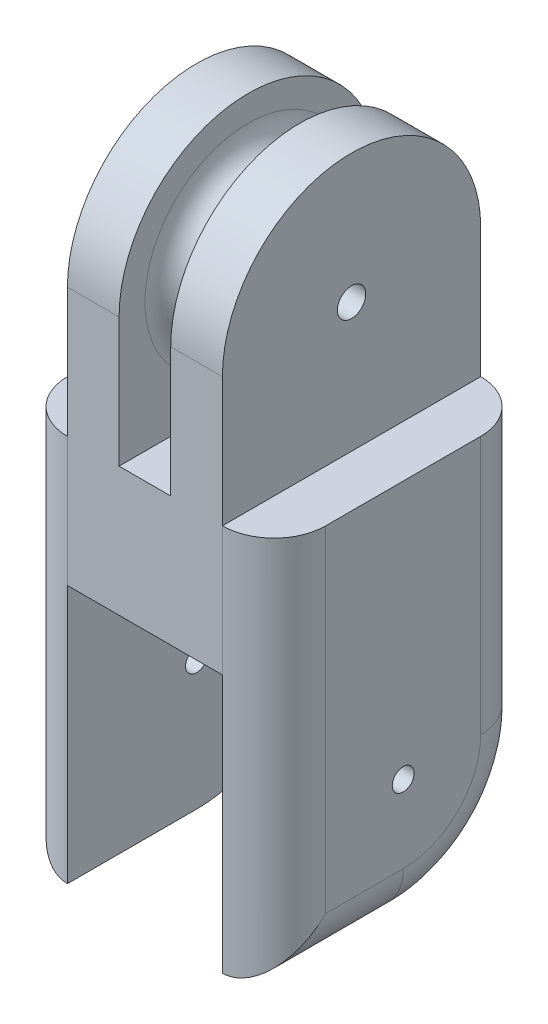
ISO-10303-21;
HEADER;
FILE_DESCRIPTION(('STEP AP214'),'2;1');
FILE_NAME('part.step','',(''),(''),'','','');
FILE_SCHEMA(('AUTOMOTIVE_DESIGN { 1 0 10303 214 1 1 1 1 }'));
ENDSEC;
DATA;
#1=APPLICATION_CONTEXT('core data for automotive mechanical design processes');
#2=APPLICATION_PROTOCOL_DEFINITION('international standard','automotive_design',2000,#1);
#3=PRODUCT_CONTEXT('',#1,'mechanical');
#4=PRODUCT('Part','Part','',(#3));
#5=PRODUCT_RELATED_PRODUCT_CATEGORY('part','',(#4));
#6=PRODUCT_DEFINITION_FORMATION('','',#4);
#7=PRODUCT_DEFINITION_CONTEXT('part definition',#1,'design');
#8=PRODUCT_DEFINITION('design','',#6,#7);
#9=PRODUCT_DEFINITION_SHAPE('','',#8);
#10=(LENGTH_UNIT() NAMED_UNIT(*) SI_UNIT(.MILLI.,.METRE.));
#11=(NAMED_UNIT(*) PLANE_ANGLE_UNIT() SI_UNIT($,.RADIAN.));
#12=(NAMED_UNIT(*) SI_UNIT($,.STERADIAN.) SOLID_ANGLE_UNIT());
#13=UNCERTAINTY_MEASURE_WITH_UNIT(LENGTH_MEASURE(1.E-05),#10,'distance_accuracy_value','');
#14=(GEOMETRIC_REPRESENTATION_CONTEXT(3) GLOBAL_UNCERTAINTY_ASSIGNED_CONTEXT((#13)) GLOBAL_UNIT_ASSIGNED_CONTEXT((#10,
#11,#12)) REPRESENTATION_CONTEXT('',''));
#15=CARTESIAN_POINT('',(0.,0.,0.));
#16=DIRECTION('',(0.,0.,1.));
#17=DIRECTION('',(1.,0.,0.));
#18=AXIS2_PLACEMENT_3D('',#15,#16,#17);
#19=CARTESIAN_POINT('',(0.,10.,0.));
#20=DIRECTION('',(0.,1.,0.));
#21=DIRECTION('',(0.,0.,1.));
#22=AXIS2_PLACEMENT_3D('',#19,#20,#21);
#23=PLANE('',#22);
#24=CARTESIAN_POINT('',(-6.,10.,6.));
#25=DIRECTION('',(0.,1.,0.));
#26=DIRECTION('',(0.,0.,1.));
#27=AXIS2_PLACEMENT_3D('',#24,#25,#26);
#28=CIRCLE('',#27,4.);
#29=CARTESIAN_POINT('',(-10.,10.,6.));
#30=VERTEX_POINT('',#29);
#31=CARTESIAN_POINT('',(-6.,10.,10.));
#32=VERTEX_POINT('',#31);
#33=EDGE_CURVE('E316',#30,#32,#28,.T.);
#34=ORIENTED_EDGE('',*,*,#33,.T.);
#35=DIRECTION('',(0.,0.,1.));
#36=VECTOR('',#35,1.);
#37=CARTESIAN_POINT('',(-6.,10.,10.));
#38=LINE('',#37,#36);
#39=CARTESIAN_POINT('',(-6.,10.,-10.));
#40=VERTEX_POINT('',#39);
#41=EDGE_CURVE('E169',#40,#32,#38,.T.);
#42=ORIENTED_EDGE('',*,*,#41,.F.);
#43=CARTESIAN_POINT('',(-6.,10.,-6.));
#44=DIRECTION('',(0.,1.,0.));
#45=DIRECTION('',(0.,0.,1.));
#46=AXIS2_PLACEMENT_3D('',#43,#44,#45);
#47=CIRCLE('',#46,4.);
#48=CARTESIAN_POINT('',(-10.,10.,-6.));
#49=VERTEX_POINT('',#48);
#50=EDGE_CURVE('E314',#40,#49,#47,.T.);
#51=ORIENTED_EDGE('',*,*,#50,.T.);
#52=DIRECTION('',(0.,0.,1.));
#53=VECTOR('',#52,1.);
#54=CARTESIAN_POINT('',(-10.,10.,-10.));
#55=LINE('',#54,#53);
#56=EDGE_CURVE('E273',#49,#30,#55,.T.);
#57=ORIENTED_EDGE('',*,*,#56,.T.);
#58=EDGE_LOOP('',(#34,#42,#51,#57));
#59=FACE_BOUND('',#58,.T.);
#60=ADVANCED_FACE('F37',(#59),#23,.T.);
#61=CARTESIAN_POINT('',(0.,10.,-6.));
#62=DIRECTION('',(0.,1.,0.));
#63=DIRECTION('',(0.,0.,1.));
#64=AXIS2_PLACEMENT_3D('',#61,#62,#63);
#65=CIRCLE('',#64,0.5);
#66=CARTESIAN_POINT('',(0.,10.,-5.5));
#67=VERTEX_POINT('',#66);
#68=EDGE_CURVE('E356',#67,#67,#65,.F.);
#69=ORIENTED_EDGE('',*,*,#68,.T.);
#70=EDGE_LOOP('',(#69));
#71=FACE_BOUND('',#70,.T.);
#72=CARTESIAN_POINT('',(0.,10.,6.));
#73=DIRECTION('',(0.,1.,0.));
#74=DIRECTION('',(0.,0.,1.));
#75=AXIS2_PLACEMENT_3D('',#72,#73,#74);
#76=CIRCLE('',#75,0.5);
#77=CARTESIAN_POINT('',(0.,10.,6.5));
#78=VERTEX_POINT('',#77);
#79=EDGE_CURVE('E364',#78,#78,#76,.F.);
#80=ORIENTED_EDGE('',*,*,#79,.T.);
#81=EDGE_LOOP('',(#80));
#82=FACE_BOUND('',#81,.T.);
#83=DIRECTION('',(-1.,0.,0.));
#84=VECTOR('',#83,1.);
#85=CARTESIAN_POINT('',(-10.,10.,-10.));
#86=LINE('',#85,#84);
#87=CARTESIAN_POINT('',(2.,10.,-10.));
#88=VERTEX_POINT('',#87);
#89=CARTESIAN_POINT('',(-2.,10.,-10.));
#90=VERTEX_POINT('',#89);
#91=EDGE_CURVE('E282',#88,#90,#86,.T.);
#92=ORIENTED_EDGE('',*,*,#91,.T.);
#93=DIRECTION('',(0.,0.,-1.));
#94=VECTOR('',#93,1.);
#95=CARTESIAN_POINT('',(-2.,10.,10.));
#96=LINE('',#95,#94);
#97=CARTESIAN_POINT('',(-2.,10.,10.));
#98=VERTEX_POINT('',#97);
#99=EDGE_CURVE('E53',#98,#90,#96,.T.);
#100=ORIENTED_EDGE('',*,*,#99,.F.);
#101=DIRECTION('',(1.,0.,0.));
#102=VECTOR('',#101,1.);
#103=CARTESIAN_POINT('',(-10.,10.,10.));
#104=LINE('',#103,#102);
#105=CARTESIAN_POINT('',(2.,10.,10.));
#106=VERTEX_POINT('',#105);
#107=EDGE_CURVE('E276',#98,#106,#104,.T.);
#108=ORIENTED_EDGE('',*,*,#107,.T.);
#109=DIRECTION('',(0.,0.,1.));
#110=VECTOR('',#109,1.);
#111=CARTESIAN_POINT('',(2.,10.,10.));
#112=LINE('',#111,#110);
#113=EDGE_CURVE('E214',#88,#106,#112,.T.);
#114=ORIENTED_EDGE('',*,*,#113,.F.);
#115=EDGE_LOOP('',(#92,#100,#108,#114));
#116=FACE_BOUND('',#115,.T.);
#117=ADVANCED_FACE('F439',(#71,#82,#116),#23,.T.);
#118=DIRECTION('',(0.,0.,-1.));
#119=VECTOR('',#118,1.);
#120=CARTESIAN_POINT('',(6.,10.,10.));
#121=LINE('',#120,#119);
#122=CARTESIAN_POINT('',(6.,10.,10.));
#123=VERTEX_POINT('',#122);
#124=CARTESIAN_POINT('',(6.,10.,-10.));
#125=VERTEX_POINT('',#124);
#126=EDGE_CURVE('E172',#123,#125,#121,.T.);
#127=ORIENTED_EDGE('',*,*,#126,.F.);
#128=CARTESIAN_POINT('',(6.,10.,6.));
#129=DIRECTION('',(0.,1.,0.));
#130=DIRECTION('',(0.,0.,1.));
#131=AXIS2_PLACEMENT_3D('',#128,#129,#130);
#132=CIRCLE('',#131,4.);
#133=CARTESIAN_POINT('',(10.,10.,6.));
#134=VERTEX_POINT('',#133);
#135=EDGE_CURVE('E318',#123,#134,#132,.T.);
#136=ORIENTED_EDGE('',*,*,#135,.T.);
#137=DIRECTION('',(0.,0.,-1.));
#138=VECTOR('',#137,1.);
#139=CARTESIAN_POINT('',(10.,10.,-10.));
#140=LINE('',#139,#138);
#141=CARTESIAN_POINT('',(10.,10.,-6.));
#142=VERTEX_POINT('',#141);
#143=EDGE_CURVE('E279',#134,#142,#140,.T.);
#144=ORIENTED_EDGE('',*,*,#143,.T.);
#145=CARTESIAN_POINT('',(6.,10.,-6.));
#146=DIRECTION('',(0.,1.,0.));
#147=DIRECTION('',(0.,0.,1.));
#148=AXIS2_PLACEMENT_3D('',#145,#146,#147);
#149=CIRCLE('',#148,4.);
#150=EDGE_CURVE('E311',#142,#125,#149,.T.);
#151=ORIENTED_EDGE('',*,*,#150,.T.);
#152=EDGE_LOOP('',(#127,#136,#144,#151));
#153=FACE_BOUND('',#152,.T.);
#154=ADVANCED_FACE('F375',(#153),#23,.T.);
#155=CARTESIAN_POINT('',(0.,0.,0.));
#156=DIRECTION('',(0.,1.,0.));
#157=DIRECTION('',(0.,0.,1.));
#158=AXIS2_PLACEMENT_3D('',#155,#156,#157);
#159=PLANE('',#158);
#160=CARTESIAN_POINT('',(0.,0.,-6.));
#161=DIRECTION('',(0.,-1.,0.));
#162=DIRECTION('',(0.,0.,-1.));
#163=AXIS2_PLACEMENT_3D('',#160,#161,#162);
#164=CIRCLE('',#163,0.5);
#165=CARTESIAN_POINT('',(0.,0.,-6.5));
#166=VERTEX_POINT('',#165);
#167=EDGE_CURVE('E352',#166,#166,#164,.T.);
#168=ORIENTED_EDGE('',*,*,#167,.F.);
#169=EDGE_LOOP('',(#168));
#170=FACE_BOUND('',#169,.T.);
#171=CARTESIAN_POINT('',(0.,0.,6.));
#172=DIRECTION('',(0.,-1.,0.));
#173=DIRECTION('',(0.,0.,1.));
#174=AXIS2_PLACEMENT_3D('',#171,#172,#173);
#175=CIRCLE('',#174,0.5);
#176=CARTESIAN_POINT('',(0.,0.,6.5));
#177=VERTEX_POINT('',#176);
#178=EDGE_CURVE('E361',#177,#177,#175,.T.);
#179=ORIENTED_EDGE('',*,*,#178,.F.);
#180=EDGE_LOOP('',(#179));
#181=FACE_BOUND('',#180,.T.);
#182=DIRECTION('',(0.,0.,-1.));
#183=VECTOR('',#182,1.);
#184=CARTESIAN_POINT('',(6.,0.,-10.));
#185=LINE('',#184,#183);
#186=CARTESIAN_POINT('',(6.,0.,10.));
#187=VERTEX_POINT('',#186);
#188=CARTESIAN_POINT('',(6.,0.,-10.));
#189=VERTEX_POINT('',#188);
#190=EDGE_CURVE('E255',#187,#189,#185,.T.);
#191=ORIENTED_EDGE('',*,*,#190,.F.);
#192=DIRECTION('',(1.,0.,0.));
#193=VECTOR('',#192,1.);
#194=CARTESIAN_POINT('',(-10.,0.,10.));
#195=LINE('',#194,#193);
#196=CARTESIAN_POINT('',(-6.,0.,10.));
#197=VERTEX_POINT('',#196);
#198=EDGE_CURVE('E272',#197,#187,#195,.T.);
#199=ORIENTED_EDGE('',*,*,#198,.F.);
#200=DIRECTION('',(0.,0.,1.));
#201=VECTOR('',#200,1.);
#202=CARTESIAN_POINT('',(-6.,0.,10.));
#203=LINE('',#202,#201);
#204=CARTESIAN_POINT('',(-6.,0.,-10.));
#205=VERTEX_POINT('',#204);
#206=EDGE_CURVE('E263',#205,#197,#203,.T.);
#207=ORIENTED_EDGE('',*,*,#206,.F.);
#208=DIRECTION('',(-1.,0.,0.));
#209=VECTOR('',#208,1.);
#210=CARTESIAN_POINT('',(-10.,0.,-10.));
#211=LINE('',#210,#209);
#212=EDGE_CURVE('E277',#189,#205,#211,.T.);
#213=ORIENTED_EDGE('',*,*,#212,.F.);
#214=EDGE_LOOP('',(#191,#199,#207,#213));
#215=FACE_BOUND('',#214,.T.);
#216=ADVANCED_FACE('F371',(#170,#181,#215),#159,.F.);
#217=CARTESIAN_POINT('',(-10.,10.,-10.));
#218=DIRECTION('',(1.,0.,0.));
#219=DIRECTION('',(0.,0.,-1.));
#220=AXIS2_PLACEMENT_3D('',#217,#218,#219);
#221=PLANE('',#220);
#222=CARTESIAN_POINT('',(-10.,-10.,0.));
#223=DIRECTION('',(-1.,0.,0.));
#224=DIRECTION('',(0.,0.,1.));
#225=AXIS2_PLACEMENT_3D('',#222,#223,#224);
#226=CIRCLE('',#225,0.85);
#227=CARTESIAN_POINT('',(-10.,-10.,0.850000000000001));
#228=VERTEX_POINT('',#227);
#229=EDGE_CURVE('E236',#228,#228,#226,.T.);
#230=ORIENTED_EDGE('',*,*,#229,.F.);
#231=EDGE_LOOP('',(#230));
#232=FACE_BOUND('',#231,.T.);
#233=DIRECTION('',(0.,0.,1.));
#234=VECTOR('',#233,1.);
#235=CARTESIAN_POINT('',(-10.,-16.,10.));
#236=LINE('',#235,#234);
#237=CARTESIAN_POINT('',(-10.,-16.,0.));
#238=VERTEX_POINT('',#237);
#239=CARTESIAN_POINT('',(-10.,-16.,6.));
#240=VERTEX_POINT('',#239);
#241=EDGE_CURVE('E292',#238,#240,#236,.T.);
#242=ORIENTED_EDGE('',*,*,#241,.T.);
#243=DIRECTION('',(0.,-1.,0.));
#244=VECTOR('',#243,1.);
#245=CARTESIAN_POINT('',(-10.,10.,6.));
#246=LINE('',#245,#244);
#247=EDGE_CURVE('E295',#240,#30,#246,.F.);
#248=ORIENTED_EDGE('',*,*,#247,.T.);
#249=ORIENTED_EDGE('',*,*,#56,.F.);
#250=DIRECTION('',(0.,-1.,0.));
#251=VECTOR('',#250,1.);
#252=CARTESIAN_POINT('',(-10.,10.,-6.));
#253=LINE('',#252,#251);
#254=CARTESIAN_POINT('',(-10.,-10.,-6.));
#255=VERTEX_POINT('',#254);
#256=EDGE_CURVE('E284',#49,#255,#253,.T.);
#257=ORIENTED_EDGE('',*,*,#256,.T.);
#258=CARTESIAN_POINT('',(-10.,-10.,0.));
#259=DIRECTION('',(1.,0.,0.));
#260=DIRECTION('',(0.,0.,-1.));
#261=AXIS2_PLACEMENT_3D('',#258,#259,#260);
#262=CIRCLE('',#261,6.);
#263=EDGE_CURVE('E290',#255,#238,#262,.F.);
#264=ORIENTED_EDGE('',*,*,#263,.T.);
#265=EDGE_LOOP('',(#242,#248,#249,#257,#264));
#266=FACE_BOUND('',#265,.T.);
#267=ADVANCED_FACE('F374',(#232,#266),#221,.F.);
#268=CARTESIAN_POINT('',(-10.,10.,10.));
#269=DIRECTION('',(0.,0.,-1.));
#270=DIRECTION('',(-1.,0.,0.));
#271=AXIS2_PLACEMENT_3D('',#268,#269,#270);
#272=PLANE('',#271);
#273=ORIENTED_EDGE('',*,*,#198,.T.);
#274=DIRECTION('',(0.,-1.,0.));
#275=VECTOR('',#274,1.);
#276=CARTESIAN_POINT('',(6.,10.,10.));
#277=LINE('',#276,#275);
#278=EDGE_CURVE('E308',#187,#123,#277,.F.);
#279=ORIENTED_EDGE('',*,*,#278,.T.);
#280=DIRECTION('',(0.,-1.,0.));
#281=VECTOR('',#280,1.);
#282=CARTESIAN_POINT('',(6.,20.,10.));
#283=LINE('',#282,#281);
#284=CARTESIAN_POINT('',(6.,20.,10.));
#285=VERTEX_POINT('',#284);
#286=EDGE_CURVE('E217',#285,#123,#283,.T.);
#287=ORIENTED_EDGE('',*,*,#286,.F.);
#288=DIRECTION('',(1.,0.,0.));
#289=VECTOR('',#288,1.);
#290=CARTESIAN_POINT('',(6.,20.,10.));
#291=LINE('',#290,#289);
#292=CARTESIAN_POINT('',(2.,20.,10.));
#293=VERTEX_POINT('',#292);
#294=EDGE_CURVE('E213',#293,#285,#291,.T.);
#295=ORIENTED_EDGE('',*,*,#294,.F.);
#296=DIRECTION('',(0.,-1.,0.));
#297=VECTOR('',#296,1.);
#298=CARTESIAN_POINT('',(2.,20.,10.));
#299=LINE('',#298,#297);
#300=EDGE_CURVE('E222',#293,#106,#299,.T.);
#301=ORIENTED_EDGE('',*,*,#300,.T.);
#302=ORIENTED_EDGE('',*,*,#107,.F.);
#303=DIRECTION('',(0.,-1.,0.));
#304=VECTOR('',#303,1.);
#305=CARTESIAN_POINT('',(-2.,20.,10.));
#306=LINE('',#305,#304);
#307=CARTESIAN_POINT('',(-2.,20.,10.));
#308=VERTEX_POINT('',#307);
#309=EDGE_CURVE('E173',#308,#98,#306,.T.);
#310=ORIENTED_EDGE('',*,*,#309,.F.);
#311=DIRECTION('',(1.,0.,0.));
#312=VECTOR('',#311,1.);
#313=CARTESIAN_POINT('',(-6.,20.,10.));
#314=LINE('',#313,#312);
#315=CARTESIAN_POINT('',(-6.,20.,10.));
#316=VERTEX_POINT('',#315);
#317=EDGE_CURVE('E176',#316,#308,#314,.T.);
#318=ORIENTED_EDGE('',*,*,#317,.F.);
#319=DIRECTION('',(0.,-1.,0.));
#320=VECTOR('',#319,1.);
#321=CARTESIAN_POINT('',(-6.,20.,10.));
#322=LINE('',#321,#320);
#323=EDGE_CURVE('E162',#316,#32,#322,.T.);
#324=ORIENTED_EDGE('',*,*,#323,.T.);
#325=DIRECTION('',(0.,-1.,0.));
#326=VECTOR('',#325,1.);
#327=CARTESIAN_POINT('',(-6.,10.,10.));
#328=LINE('',#327,#326);
#329=EDGE_CURVE('E306',#32,#197,#328,.T.);
#330=ORIENTED_EDGE('',*,*,#329,.T.);
#331=EDGE_LOOP('',(#273,#279,#287,#295,#301,#302,#310,#318,#324,#330));
#332=FACE_BOUND('',#331,.T.);
#333=ADVANCED_FACE('F178',(#332),#272,.F.);
#334=CARTESIAN_POINT('',(10.,10.,-10.));
#335=DIRECTION('',(-1.,0.,0.));
#336=DIRECTION('',(0.,0.,1.));
#337=AXIS2_PLACEMENT_3D('',#334,#335,#336);
#338=PLANE('',#337);
#339=CARTESIAN_POINT('',(10.,-10.,0.));
#340=DIRECTION('',(-1.,0.,0.));
#341=DIRECTION('',(0.,0.,1.));
#342=AXIS2_PLACEMENT_3D('',#339,#340,#341);
#343=CIRCLE('',#342,0.85);
#344=CARTESIAN_POINT('',(10.,-10.,0.849999999999999));
#345=VERTEX_POINT('',#344);
#346=EDGE_CURVE('E232',#345,#345,#343,.T.);
#347=ORIENTED_EDGE('',*,*,#346,.T.);
#348=EDGE_LOOP('',(#347));
#349=FACE_BOUND('',#348,.T.);
#350=ORIENTED_EDGE('',*,*,#143,.F.);
#351=DIRECTION('',(0.,-1.,0.));
#352=VECTOR('',#351,1.);
#353=CARTESIAN_POINT('',(10.,10.,6.));
#354=LINE('',#353,#352);
#355=CARTESIAN_POINT('',(10.,-16.,6.));
#356=VERTEX_POINT('',#355);
#357=EDGE_CURVE('E304',#134,#356,#354,.T.);
#358=ORIENTED_EDGE('',*,*,#357,.T.);
#359=DIRECTION('',(0.,0.,-1.));
#360=VECTOR('',#359,1.);
#361=CARTESIAN_POINT('',(10.,-16.,0.));
#362=LINE('',#361,#360);
#363=CARTESIAN_POINT('',(10.,-16.,0.));
#364=VERTEX_POINT('',#363);
#365=EDGE_CURVE('E301',#356,#364,#362,.T.);
#366=ORIENTED_EDGE('',*,*,#365,.T.);
#367=CARTESIAN_POINT('',(10.,-10.,0.));
#368=DIRECTION('',(-1.,0.,0.));
#369=DIRECTION('',(0.,0.,1.));
#370=AXIS2_PLACEMENT_3D('',#367,#368,#369);
#371=CIRCLE('',#370,6.);
#372=CARTESIAN_POINT('',(10.,-10.,-6.));
#373=VERTEX_POINT('',#372);
#374=EDGE_CURVE('E299',#364,#373,#371,.F.);
#375=ORIENTED_EDGE('',*,*,#374,.T.);
#376=DIRECTION('',(0.,-1.,0.));
#377=VECTOR('',#376,1.);
#378=CARTESIAN_POINT('',(10.,10.,-6.));
#379=LINE('',#378,#377);
#380=EDGE_CURVE('E297',#373,#142,#379,.F.);
#381=ORIENTED_EDGE('',*,*,#380,.T.);
#382=EDGE_LOOP('',(#350,#358,#366,#375,#381));
#383=FACE_BOUND('',#382,.T.);
#384=ADVANCED_FACE('F434',(#349,#383),#338,.F.);
#385=CARTESIAN_POINT('',(-10.,10.,-10.));
#386=DIRECTION('',(0.,0.,1.));
#387=DIRECTION('',(1.,0.,0.));
#388=AXIS2_PLACEMENT_3D('',#385,#386,#387);
#389=PLANE('',#388);
#390=ORIENTED_EDGE('',*,*,#212,.T.);
#391=DIRECTION('',(0.,-1.,0.));
#392=VECTOR('',#391,1.);
#393=CARTESIAN_POINT('',(-6.,10.,-10.));
#394=LINE('',#393,#392);
#395=EDGE_CURVE('E322',#205,#40,#394,.F.);
#396=ORIENTED_EDGE('',*,*,#395,.T.);
#397=DIRECTION('',(0.,-1.,0.));
#398=VECTOR('',#397,1.);
#399=CARTESIAN_POINT('',(-6.,20.,-10.));
#400=LINE('',#399,#398);
#401=CARTESIAN_POINT('',(-6.,20.,-10.));
#402=VERTEX_POINT('',#401);
#403=EDGE_CURVE('E202',#402,#40,#400,.T.);
#404=ORIENTED_EDGE('',*,*,#403,.F.);
#405=DIRECTION('',(-1.,0.,0.));
#406=VECTOR('',#405,1.);
#407=CARTESIAN_POINT('',(-6.,20.,-10.));
#408=LINE('',#407,#406);
#409=CARTESIAN_POINT('',(-2.,20.,-10.));
#410=VERTEX_POINT('',#409);
#411=EDGE_CURVE('E182',#410,#402,#408,.T.);
#412=ORIENTED_EDGE('',*,*,#411,.F.);
#413=DIRECTION('',(0.,-1.,0.));
#414=VECTOR('',#413,1.);
#415=CARTESIAN_POINT('',(-2.,20.,-10.));
#416=LINE('',#415,#414);
#417=EDGE_CURVE('E206',#410,#90,#416,.T.);
#418=ORIENTED_EDGE('',*,*,#417,.T.);
#419=ORIENTED_EDGE('',*,*,#91,.F.);
#420=DIRECTION('',(0.,-1.,0.));
#421=VECTOR('',#420,1.);
#422=CARTESIAN_POINT('',(2.,20.,-10.));
#423=LINE('',#422,#421);
#424=CARTESIAN_POINT('',(2.,20.,-10.));
#425=VERTEX_POINT('',#424);
#426=EDGE_CURVE('E225',#425,#88,#423,.T.);
#427=ORIENTED_EDGE('',*,*,#426,.F.);
#428=DIRECTION('',(-1.,0.,0.));
#429=VECTOR('',#428,1.);
#430=CARTESIAN_POINT('',(6.,20.,-10.));
#431=LINE('',#430,#429);
#432=CARTESIAN_POINT('',(6.,20.,-10.));
#433=VERTEX_POINT('',#432);
#434=EDGE_CURVE('E210',#433,#425,#431,.T.);
#435=ORIENTED_EDGE('',*,*,#434,.F.);
#436=DIRECTION('',(0.,-1.,0.));
#437=VECTOR('',#436,1.);
#438=CARTESIAN_POINT('',(6.,20.,-10.));
#439=LINE('',#438,#437);
#440=EDGE_CURVE('E228',#433,#125,#439,.T.);
#441=ORIENTED_EDGE('',*,*,#440,.T.);
#442=DIRECTION('',(0.,-1.,0.));
#443=VECTOR('',#442,1.);
#444=CARTESIAN_POINT('',(6.,10.,-10.));
#445=LINE('',#444,#443);
#446=EDGE_CURVE('E320',#125,#189,#445,.T.);
#447=ORIENTED_EDGE('',*,*,#446,.T.);
#448=EDGE_LOOP('',(#390,#396,#404,#412,#418,#419,#427,#435,#441,#447));
#449=FACE_BOUND('',#448,.T.);
#450=ADVANCED_FACE('F404',(#449),#389,.F.);
#451=CARTESIAN_POINT('',(-6.,-10.,10.));
#452=DIRECTION('',(-1.,0.,0.));
#453=DIRECTION('',(0.,0.,1.));
#454=AXIS2_PLACEMENT_3D('',#451,#452,#453);
#455=PLANE('',#454);
#456=CARTESIAN_POINT('',(-6.,-10.,0.));
#457=DIRECTION('',(-1.,0.,0.));
#458=DIRECTION('',(0.,0.,1.));
#459=AXIS2_PLACEMENT_3D('',#456,#457,#458);
#460=CIRCLE('',#459,0.85);
#461=CARTESIAN_POINT('',(-6.,-10.,0.850000000000001));
#462=VERTEX_POINT('',#461);
#463=EDGE_CURVE('E240',#462,#462,#460,.T.);
#464=ORIENTED_EDGE('',*,*,#463,.T.);
#465=EDGE_LOOP('',(#464));
#466=FACE_BOUND('',#465,.T.);
#467=ORIENTED_EDGE('',*,*,#206,.T.);
#468=DIRECTION('',(0.,1.,0.));
#469=VECTOR('',#468,1.);
#470=CARTESIAN_POINT('',(-6.,-10.,10.));
#471=LINE('',#470,#469);
#472=CARTESIAN_POINT('',(-6.,-20.,10.));
#473=VERTEX_POINT('',#472);
#474=EDGE_CURVE('E266',#473,#197,#471,.T.);
#475=ORIENTED_EDGE('',*,*,#474,.F.);
#476=DIRECTION('',(0.,0.,1.));
#477=VECTOR('',#476,1.);
#478=CARTESIAN_POINT('',(-6.,-20.,0.));
#479=LINE('',#478,#477);
#480=CARTESIAN_POINT('',(-6.,-20.,0.));
#481=VERTEX_POINT('',#480);
#482=EDGE_CURVE('E252',#481,#473,#479,.T.);
#483=ORIENTED_EDGE('',*,*,#482,.F.);
#484=CARTESIAN_POINT('',(-6.,-10.,0.));
#485=DIRECTION('',(-1.,0.,0.));
#486=DIRECTION('',(0.,0.,1.));
#487=AXIS2_PLACEMENT_3D('',#484,#485,#486);
#488=CIRCLE('',#487,10.);
#489=CARTESIAN_POINT('',(-6.,-10.,-10.));
#490=VERTEX_POINT('',#489);
#491=EDGE_CURVE('E249',#490,#481,#488,.T.);
#492=ORIENTED_EDGE('',*,*,#491,.F.);
#493=DIRECTION('',(0.,1.,0.));
#494=VECTOR('',#493,1.);
#495=CARTESIAN_POINT('',(-6.,-10.,-10.));
#496=LINE('',#495,#494);
#497=EDGE_CURVE('E269',#490,#205,#496,.T.);
#498=ORIENTED_EDGE('',*,*,#497,.T.);
#499=EDGE_LOOP('',(#467,#475,#483,#492,#498));
#500=FACE_BOUND('',#499,.T.);
#501=ADVANCED_FACE('F416',(#466,#500),#455,.F.);
#502=CARTESIAN_POINT('',(6.,-10.,-10.));
#503=DIRECTION('',(1.,0.,0.));
#504=DIRECTION('',(0.,0.,-1.));
#505=AXIS2_PLACEMENT_3D('',#502,#503,#504);
#506=PLANE('',#505);
#507=CARTESIAN_POINT('',(6.,-10.,0.));
#508=DIRECTION('',(1.,0.,0.));
#509=DIRECTION('',(0.,0.,-1.));
#510=AXIS2_PLACEMENT_3D('',#507,#508,#509);
#511=CIRCLE('',#510,0.85);
#512=CARTESIAN_POINT('',(6.,-10.,-0.850000000000001));
#513=VERTEX_POINT('',#512);
#514=EDGE_CURVE('E235',#513,#513,#511,.T.);
#515=ORIENTED_EDGE('',*,*,#514,.T.);
#516=EDGE_LOOP('',(#515));
#517=FACE_BOUND('',#516,.T.);
#518=ORIENTED_EDGE('',*,*,#190,.T.);
#519=DIRECTION('',(0.,1.,0.));
#520=VECTOR('',#519,1.);
#521=CARTESIAN_POINT('',(6.,-10.,-10.));
#522=LINE('',#521,#520);
#523=CARTESIAN_POINT('',(6.,-10.,-10.));
#524=VERTEX_POINT('',#523);
#525=EDGE_CURVE('E258',#524,#189,#522,.T.);
#526=ORIENTED_EDGE('',*,*,#525,.F.);
#527=CARTESIAN_POINT('',(6.,-10.,0.));
#528=DIRECTION('',(1.,0.,0.));
#529=DIRECTION('',(0.,0.,-1.));
#530=AXIS2_PLACEMENT_3D('',#527,#528,#529);
#531=CIRCLE('',#530,10.);
#532=CARTESIAN_POINT('',(6.,-20.,0.));
#533=VERTEX_POINT('',#532);
#534=EDGE_CURVE('E246',#533,#524,#531,.T.);
#535=ORIENTED_EDGE('',*,*,#534,.F.);
#536=DIRECTION('',(0.,0.,-1.));
#537=VECTOR('',#536,1.);
#538=CARTESIAN_POINT('',(6.,-20.,0.));
#539=LINE('',#538,#537);
#540=CARTESIAN_POINT('',(6.,-20.,9.99999999999999));
#541=VERTEX_POINT('',#540);
#542=EDGE_CURVE('E243',#541,#533,#539,.T.);
#543=ORIENTED_EDGE('',*,*,#542,.F.);
#544=DIRECTION('',(0.,1.,0.));
#545=VECTOR('',#544,1.);
#546=CARTESIAN_POINT('',(6.,-10.,10.));
#547=LINE('',#546,#545);
#548=EDGE_CURVE('E261',#541,#187,#547,.T.);
#549=ORIENTED_EDGE('',*,*,#548,.T.);
#550=EDGE_LOOP('',(#518,#526,#535,#543,#549));
#551=FACE_BOUND('',#550,.T.);
#552=ADVANCED_FACE('F455',(#517,#551),#506,.F.);
#553=CARTESIAN_POINT('',(10.,-10.,0.));
#554=DIRECTION('',(-1.,0.,0.));
#555=DIRECTION('',(0.,0.,1.));
#556=AXIS2_PLACEMENT_3D('',#553,#554,#555);
#557=CYLINDRICAL_SURFACE('',#556,0.85);
#558=ORIENTED_EDGE('',*,*,#346,.F.);
#559=EDGE_LOOP('',(#558));
#560=FACE_BOUND('',#559,.T.);
#561=ORIENTED_EDGE('',*,*,#514,.F.);
#562=EDGE_LOOP('',(#561));
#563=FACE_BOUND('',#562,.T.);
#564=ADVANCED_FACE('F473',(#560,#563),#557,.F.);
#565=ORIENTED_EDGE('',*,*,#229,.T.);
#566=EDGE_LOOP('',(#565));
#567=FACE_BOUND('',#566,.T.);
#568=ORIENTED_EDGE('',*,*,#463,.F.);
#569=EDGE_LOOP('',(#568));
#570=FACE_BOUND('',#569,.T.);
#571=ADVANCED_FACE('F476',(#567,#570),#557,.F.);
#572=CARTESIAN_POINT('',(-6.,10.,-6.));
#573=DIRECTION('',(0.,-1.,0.));
#574=DIRECTION('',(0.,0.,-1.));
#575=AXIS2_PLACEMENT_3D('',#572,#573,#574);
#576=CYLINDRICAL_SURFACE('',#575,4.);
#577=ORIENTED_EDGE('',*,*,#395,.F.);
#578=ORIENTED_EDGE('',*,*,#497,.F.);
#579=CARTESIAN_POINT('',(-6.,-10.,-6.));
#580=DIRECTION('',(0.,-1.,0.));
#581=DIRECTION('',(0.,0.,-1.));
#582=AXIS2_PLACEMENT_3D('',#579,#580,#581);
#583=CIRCLE('',#582,4.);
#584=EDGE_CURVE('E239',#255,#490,#583,.T.);
#585=ORIENTED_EDGE('',*,*,#584,.F.);
#586=ORIENTED_EDGE('',*,*,#256,.F.);
#587=ORIENTED_EDGE('',*,*,#50,.F.);
#588=EDGE_LOOP('',(#577,#578,#585,#586,#587));
#589=FACE_BOUND('',#588,.T.);
#590=ADVANCED_FACE('F425',(#589),#576,.T.);
#591=CARTESIAN_POINT('',(-6.,-10.,0.));
#592=DIRECTION('',(1.,0.,0.));
#593=DIRECTION('',(0.,0.,-1.));
#594=AXIS2_PLACEMENT_3D('',#591,#592,#593);
#595=TOROIDAL_SURFACE('',#594,6.,4.);
#596=ORIENTED_EDGE('',*,*,#584,.T.);
#597=ORIENTED_EDGE('',*,*,#491,.T.);
#598=CARTESIAN_POINT('',(-6.,-16.,0.));
#599=DIRECTION('',(0.,0.,1.));
#600=DIRECTION('',(1.,0.,0.));
#601=AXIS2_PLACEMENT_3D('',#598,#599,#600);
#602=CIRCLE('',#601,4.);
#603=EDGE_CURVE('E327',#238,#481,#602,.T.);
#604=ORIENTED_EDGE('',*,*,#603,.F.);
#605=ORIENTED_EDGE('',*,*,#263,.F.);
#606=EDGE_LOOP('',(#596,#597,#604,#605));
#607=FACE_BOUND('',#606,.T.);
#608=ADVANCED_FACE('F423',(#607),#595,.T.);
#609=CARTESIAN_POINT('',(-6.,10.,6.));
#610=DIRECTION('',(0.,-1.,0.));
#611=DIRECTION('',(0.,0.,-1.));
#612=AXIS2_PLACEMENT_3D('',#609,#610,#611);
#613=CYLINDRICAL_SURFACE('',#612,4.);
#614=ORIENTED_EDGE('',*,*,#33,.F.);
#615=ORIENTED_EDGE('',*,*,#247,.F.);
#616=CARTESIAN_POINT('',(-6.,-16.,6.));
#617=DIRECTION('',(0.,-0.707106781186547,-0.707106781186547));
#618=DIRECTION('',(0.,-0.707106781186547,0.707106781186547));
#619=AXIS2_PLACEMENT_3D('',#616,#617,#618);
#620=ELLIPSE('',#619,5.65685424949238,4.);
#621=EDGE_CURVE('E325',#473,#240,#620,.T.);
#622=ORIENTED_EDGE('',*,*,#621,.F.);
#623=ORIENTED_EDGE('',*,*,#474,.T.);
#624=ORIENTED_EDGE('',*,*,#329,.F.);
#625=EDGE_LOOP('',(#614,#615,#622,#623,#624));
#626=FACE_BOUND('',#625,.T.);
#627=ADVANCED_FACE('F413',(#626),#613,.T.);
#628=CARTESIAN_POINT('',(-6.,-16.,-10.));
#629=DIRECTION('',(0.,0.,-1.));
#630=DIRECTION('',(-1.,0.,0.));
#631=AXIS2_PLACEMENT_3D('',#628,#629,#630);
#632=CYLINDRICAL_SURFACE('',#631,4.);
#633=ORIENTED_EDGE('',*,*,#603,.T.);
#634=ORIENTED_EDGE('',*,*,#482,.T.);
#635=ORIENTED_EDGE('',*,*,#621,.T.);
#636=ORIENTED_EDGE('',*,*,#241,.F.);
#637=EDGE_LOOP('',(#633,#634,#635,#636));
#638=FACE_BOUND('',#637,.T.);
#639=ADVANCED_FACE('F418',(#638),#632,.T.);
#640=CARTESIAN_POINT('',(6.,10.,-6.));
#641=DIRECTION('',(0.,-1.,0.));
#642=DIRECTION('',(0.,0.,-1.));
#643=AXIS2_PLACEMENT_3D('',#640,#641,#642);
#644=CYLINDRICAL_SURFACE('',#643,4.);
#645=ORIENTED_EDGE('',*,*,#150,.F.);
#646=ORIENTED_EDGE('',*,*,#380,.F.);
#647=CARTESIAN_POINT('',(6.,-10.,-6.));
#648=DIRECTION('',(0.,-1.,0.));
#649=DIRECTION('',(0.,0.,-1.));
#650=AXIS2_PLACEMENT_3D('',#647,#648,#649);
#651=CIRCLE('',#650,4.);
#652=EDGE_CURVE('E328',#524,#373,#651,.T.);
#653=ORIENTED_EDGE('',*,*,#652,.F.);
#654=ORIENTED_EDGE('',*,*,#525,.T.);
#655=ORIENTED_EDGE('',*,*,#446,.F.);
#656=EDGE_LOOP('',(#645,#646,#653,#654,#655));
#657=FACE_BOUND('',#656,.T.);
#658=ADVANCED_FACE('F453',(#657),#644,.T.);
#659=CARTESIAN_POINT('',(6.,10.,6.));
#660=DIRECTION('',(0.,-1.,0.));
#661=DIRECTION('',(0.,0.,-1.));
#662=AXIS2_PLACEMENT_3D('',#659,#660,#661);
#663=CYLINDRICAL_SURFACE('',#662,4.);
#664=ORIENTED_EDGE('',*,*,#278,.F.);
#665=ORIENTED_EDGE('',*,*,#548,.F.);
#666=CARTESIAN_POINT('',(6.,-16.,6.));
#667=DIRECTION('',(0.,-0.707106781186547,-0.707106781186547));
#668=DIRECTION('',(0.,-0.707106781186547,0.707106781186547));
#669=AXIS2_PLACEMENT_3D('',#666,#667,#668);
#670=ELLIPSE('',#669,5.65685424949238,4.);
#671=EDGE_CURVE('E334',#356,#541,#670,.T.);
#672=ORIENTED_EDGE('',*,*,#671,.F.);
#673=ORIENTED_EDGE('',*,*,#357,.F.);
#674=ORIENTED_EDGE('',*,*,#135,.F.);
#675=EDGE_LOOP('',(#664,#665,#672,#673,#674));
#676=FACE_BOUND('',#675,.T.);
#677=ADVANCED_FACE('F388',(#676),#663,.T.);
#678=CARTESIAN_POINT('',(6.,-10.,0.));
#679=DIRECTION('',(-1.,0.,0.));
#680=DIRECTION('',(0.,0.,1.));
#681=AXIS2_PLACEMENT_3D('',#678,#679,#680);
#682=TOROIDAL_SURFACE('',#681,6.,4.);
#683=ORIENTED_EDGE('',*,*,#652,.T.);
#684=ORIENTED_EDGE('',*,*,#374,.F.);
#685=CARTESIAN_POINT('',(6.,-16.,0.));
#686=DIRECTION('',(0.,0.,1.));
#687=DIRECTION('',(1.,0.,0.));
#688=AXIS2_PLACEMENT_3D('',#685,#686,#687);
#689=CIRCLE('',#688,4.);
#690=EDGE_CURVE('E231',#533,#364,#689,.T.);
#691=ORIENTED_EDGE('',*,*,#690,.F.);
#692=ORIENTED_EDGE('',*,*,#534,.T.);
#693=EDGE_LOOP('',(#683,#684,#691,#692));
#694=FACE_BOUND('',#693,.T.);
#695=ADVANCED_FACE('F462',(#694),#682,.T.);
#696=CARTESIAN_POINT('',(6.,-16.,-10.));
#697=DIRECTION('',(0.,0.,1.));
#698=DIRECTION('',(1.,0.,0.));
#699=AXIS2_PLACEMENT_3D('',#696,#697,#698);
#700=CYLINDRICAL_SURFACE('',#699,4.);
#701=ORIENTED_EDGE('',*,*,#671,.T.);
#702=ORIENTED_EDGE('',*,*,#542,.T.);
#703=ORIENTED_EDGE('',*,*,#690,.T.);
#704=ORIENTED_EDGE('',*,*,#365,.F.);
#705=EDGE_LOOP('',(#701,#702,#703,#704));
#706=FACE_BOUND('',#705,.T.);
#707=ADVANCED_FACE('F459',(#706),#700,.T.);
#708=CARTESIAN_POINT('',(6.,20.,10.));
#709=DIRECTION('',(-1.,0.,0.));
#710=DIRECTION('',(0.,0.,1.));
#711=AXIS2_PLACEMENT_3D('',#708,#709,#710);
#712=PLANE('',#711);
#713=CARTESIAN_POINT('',(6.,20.,0.));
#714=DIRECTION('',(-1.,0.,0.));
#715=DIRECTION('',(0.,0.,1.));
#716=AXIS2_PLACEMENT_3D('',#713,#714,#715);
#717=CIRCLE('',#716,1.1);
#718=CARTESIAN_POINT('',(6.,20.,1.1));
#719=VERTEX_POINT('',#718);
#720=EDGE_CURVE('E188',#719,#719,#717,.T.);
#721=ORIENTED_EDGE('',*,*,#720,.T.);
#722=EDGE_LOOP('',(#721));
#723=FACE_BOUND('',#722,.T.);
#724=ORIENTED_EDGE('',*,*,#126,.T.);
#725=ORIENTED_EDGE('',*,*,#440,.F.);
#726=CARTESIAN_POINT('',(6.,20.,0.));
#727=DIRECTION('',(1.,0.,0.));
#728=DIRECTION('',(0.,0.,-1.));
#729=AXIS2_PLACEMENT_3D('',#726,#727,#728);
#730=CIRCLE('',#729,10.);
#731=EDGE_CURVE('E190',#433,#285,#730,.T.);
#732=ORIENTED_EDGE('',*,*,#731,.T.);
#733=ORIENTED_EDGE('',*,*,#286,.T.);
#734=EDGE_LOOP('',(#724,#725,#732,#733));
#735=FACE_BOUND('',#734,.T.);
#736=ADVANCED_FACE('F394',(#723,#735),#712,.F.);
#737=CARTESIAN_POINT('',(2.,20.,10.));
#738=DIRECTION('',(1.,0.,0.));
#739=DIRECTION('',(0.,0.,-1.));
#740=AXIS2_PLACEMENT_3D('',#737,#738,#739);
#741=PLANE('',#740);
#742=CARTESIAN_POINT('',(2.,20.,0.));
#743=DIRECTION('',(1.,0.,0.));
#744=DIRECTION('',(0.,0.,-1.));
#745=AXIS2_PLACEMENT_3D('',#742,#743,#744);
#746=CIRCLE('',#745,8.);
#747=CARTESIAN_POINT('',(2.,20.,-8.));
#748=VERTEX_POINT('',#747);
#749=EDGE_CURVE('E46',#748,#748,#746,.T.);
#750=ORIENTED_EDGE('',*,*,#749,.T.);
#751=EDGE_LOOP('',(#750));
#752=FACE_BOUND('',#751,.T.);
#753=ORIENTED_EDGE('',*,*,#113,.T.);
#754=ORIENTED_EDGE('',*,*,#300,.F.);
#755=CARTESIAN_POINT('',(2.,20.,0.));
#756=DIRECTION('',(1.,0.,0.));
#757=DIRECTION('',(0.,0.,-1.));
#758=AXIS2_PLACEMENT_3D('',#755,#756,#757);
#759=CIRCLE('',#758,10.);
#760=EDGE_CURVE('E196',#425,#293,#759,.T.);
#761=ORIENTED_EDGE('',*,*,#760,.F.);
#762=ORIENTED_EDGE('',*,*,#426,.T.);
#763=EDGE_LOOP('',(#753,#754,#761,#762));
#764=FACE_BOUND('',#763,.T.);
#765=ADVANCED_FACE('F342',(#752,#764),#741,.F.);
#766=CARTESIAN_POINT('',(-6.,20.,10.));
#767=DIRECTION('',(1.,0.,0.));
#768=DIRECTION('',(0.,0.,-1.));
#769=AXIS2_PLACEMENT_3D('',#766,#767,#768);
#770=PLANE('',#769);
#771=CARTESIAN_POINT('',(-6.,20.,0.));
#772=DIRECTION('',(-1.,0.,0.));
#773=DIRECTION('',(0.,0.,1.));
#774=AXIS2_PLACEMENT_3D('',#771,#772,#773);
#775=CIRCLE('',#774,1.1);
#776=CARTESIAN_POINT('',(-6.,20.,1.1));
#777=VERTEX_POINT('',#776);
#778=EDGE_CURVE('E193',#777,#777,#775,.T.);
#779=ORIENTED_EDGE('',*,*,#778,.F.);
#780=EDGE_LOOP('',(#779));
#781=FACE_BOUND('',#780,.T.);
#782=ORIENTED_EDGE('',*,*,#41,.T.);
#783=ORIENTED_EDGE('',*,*,#323,.F.);
#784=CARTESIAN_POINT('',(-6.,20.,0.));
#785=DIRECTION('',(-1.,0.,0.));
#786=DIRECTION('',(0.,0.,1.));
#787=AXIS2_PLACEMENT_3D('',#784,#785,#786);
#788=CIRCLE('',#787,10.);
#789=EDGE_CURVE('E167',#316,#402,#788,.T.);
#790=ORIENTED_EDGE('',*,*,#789,.T.);
#791=ORIENTED_EDGE('',*,*,#403,.T.);
#792=EDGE_LOOP('',(#782,#783,#790,#791));
#793=FACE_BOUND('',#792,.T.);
#794=ADVANCED_FACE('F164',(#781,#793),#770,.F.);
#795=CARTESIAN_POINT('',(-2.,20.,10.));
#796=DIRECTION('',(-1.,0.,0.));
#797=DIRECTION('',(0.,0.,1.));
#798=AXIS2_PLACEMENT_3D('',#795,#796,#797);
#799=PLANE('',#798);
#800=CARTESIAN_POINT('',(-2.,20.,0.));
#801=DIRECTION('',(-1.,0.,0.));
#802=DIRECTION('',(0.,0.,1.));
#803=AXIS2_PLACEMENT_3D('',#800,#801,#802);
#804=CIRCLE('',#803,8.);
#805=CARTESIAN_POINT('',(-2.,20.,8.));
#806=VERTEX_POINT('',#805);
#807=EDGE_CURVE('E11',#806,#806,#804,.T.);
#808=ORIENTED_EDGE('',*,*,#807,.T.);
#809=EDGE_LOOP('',(#808));
#810=FACE_BOUND('',#809,.T.);
#811=ORIENTED_EDGE('',*,*,#99,.T.);
#812=ORIENTED_EDGE('',*,*,#417,.F.);
#813=CARTESIAN_POINT('',(-2.,20.,0.));
#814=DIRECTION('',(-1.,0.,0.));
#815=DIRECTION('',(0.,0.,1.));
#816=AXIS2_PLACEMENT_3D('',#813,#814,#815);
#817=CIRCLE('',#816,10.);
#818=EDGE_CURVE('E187',#308,#410,#817,.T.);
#819=ORIENTED_EDGE('',*,*,#818,.F.);
#820=ORIENTED_EDGE('',*,*,#309,.T.);
#821=EDGE_LOOP('',(#811,#812,#819,#820));
#822=FACE_BOUND('',#821,.T.);
#823=ADVANCED_FACE('F401',(#810,#822),#799,.F.);
#824=CARTESIAN_POINT('',(2.,20.,0.));
#825=DIRECTION('',(1.,0.,0.));
#826=DIRECTION('',(0.,0.,-1.));
#827=AXIS2_PLACEMENT_3D('',#824,#825,#826);
#828=CYLINDRICAL_SURFACE('',#827,10.);
#829=ORIENTED_EDGE('',*,*,#760,.T.);
#830=ORIENTED_EDGE('',*,*,#294,.T.);
#831=ORIENTED_EDGE('',*,*,#731,.F.);
#832=ORIENTED_EDGE('',*,*,#434,.T.);
#833=EDGE_LOOP('',(#829,#830,#831,#832));
#834=FACE_BOUND('',#833,.T.);
#835=ADVANCED_FACE('F398',(#834),#828,.T.);
#836=CARTESIAN_POINT('',(-2.,20.,0.));
#837=DIRECTION('',(-1.,0.,0.));
#838=DIRECTION('',(0.,0.,1.));
#839=AXIS2_PLACEMENT_3D('',#836,#837,#838);
#840=CYLINDRICAL_SURFACE('',#839,10.);
#841=ORIENTED_EDGE('',*,*,#317,.T.);
#842=ORIENTED_EDGE('',*,*,#818,.T.);
#843=ORIENTED_EDGE('',*,*,#411,.T.);
#844=ORIENTED_EDGE('',*,*,#789,.F.);
#845=EDGE_LOOP('',(#841,#842,#843,#844));
#846=FACE_BOUND('',#845,.T.);
#847=ADVANCED_FACE('F185',(#846),#840,.T.);
#848=CARTESIAN_POINT('',(10.,20.,0.));
#849=DIRECTION('',(-1.,0.,0.));
#850=DIRECTION('',(0.,0.,1.));
#851=AXIS2_PLACEMENT_3D('',#848,#849,#850);
#852=CYLINDRICAL_SURFACE('',#851,1.1);
#853=ORIENTED_EDGE('',*,*,#720,.F.);
#854=EDGE_LOOP('',(#853));
#855=FACE_BOUND('',#854,.T.);
#856=ORIENTED_EDGE('',*,*,#778,.T.);
#857=EDGE_LOOP('',(#856));
#858=FACE_BOUND('',#857,.T.);
#859=ADVANCED_FACE('F504',(#855,#858),#852,.F.);
#860=CARTESIAN_POINT('',(0.,20.,0.));
#861=DIRECTION('',(-1.,0.,0.));
#862=DIRECTION('',(0.,0.,1.));
#863=AXIS2_PLACEMENT_3D('',#860,#861,#862);
#864=TOROIDAL_SURFACE('',#863,8.,2.);
#865=ORIENTED_EDGE('',*,*,#807,.F.);
#866=EDGE_LOOP('',(#865));
#867=FACE_BOUND('',#866,.T.);
#868=CARTESIAN_POINT('',(0.,20.,0.));
#869=DIRECTION('',(-1.,0.,0.));
#870=DIRECTION('',(0.,0.,1.));
#871=AXIS2_PLACEMENT_3D('',#868,#869,#870);
#872=CIRCLE('',#871,6.);
#873=CARTESIAN_POINT('',(0.,20.,6.));
#874=VERTEX_POINT('',#873);
#875=EDGE_CURVE('E41',#874,#874,#872,.F.);
#876=ORIENTED_EDGE('',*,*,#875,.F.);
#877=EDGE_LOOP('',(#876));
#878=FACE_BOUND('',#877,.T.);
#879=ADVANCED_FACE('F39',(#867,#878),#864,.F.);
#880=CARTESIAN_POINT('',(0.,20.,0.));
#881=DIRECTION('',(1.,0.,0.));
#882=DIRECTION('',(0.,0.,-1.));
#883=AXIS2_PLACEMENT_3D('',#880,#881,#882);
#884=TOROIDAL_SURFACE('',#883,8.,2.);
#885=ORIENTED_EDGE('',*,*,#749,.F.);
#886=EDGE_LOOP('',(#885));
#887=FACE_BOUND('',#886,.T.);
#888=ORIENTED_EDGE('',*,*,#875,.T.);
#889=EDGE_LOOP('',(#888));
#890=FACE_BOUND('',#889,.T.);
#891=ADVANCED_FACE('F345',(#887,#890),#884,.F.);
#892=CARTESIAN_POINT('',(0.,30.001,6.));
#893=DIRECTION('',(0.,-1.,0.));
#894=DIRECTION('',(0.,0.,-1.));
#895=AXIS2_PLACEMENT_3D('',#892,#893,#894);
#896=CYLINDRICAL_SURFACE('',#895,0.5);
#897=ORIENTED_EDGE('',*,*,#79,.F.);
#898=EDGE_LOOP('',(#897));
#899=FACE_BOUND('',#898,.T.);
#900=ORIENTED_EDGE('',*,*,#178,.T.);
#901=EDGE_LOOP('',(#900));
#902=FACE_BOUND('',#901,.T.);
#903=ADVANCED_FACE('F348',(#899,#902),#896,.F.);
#904=CARTESIAN_POINT('',(0.,30.001,-6.));
#905=DIRECTION('',(0.,-1.,0.));
#906=DIRECTION('',(0.,0.,-1.));
#907=AXIS2_PLACEMENT_3D('',#904,#905,#906);
#908=CYLINDRICAL_SURFACE('',#907,0.5);
#909=ORIENTED_EDGE('',*,*,#68,.F.);
#910=EDGE_LOOP('',(#909));
#911=FACE_BOUND('',#910,.T.);
#912=ORIENTED_EDGE('',*,*,#167,.T.);
#913=EDGE_LOOP('',(#912));
#914=FACE_BOUND('',#913,.T.);
#915=ADVANCED_FACE('F510',(#911,#914),#908,.F.);
#916=CLOSED_SHELL('',(#60,#117,#154,#216,#267,#333,#384,#450,#501,#552,#564,#571,#590,#608,#627,
#639,#658,#677,#695,#707,#736,#765,#794,#823,#835,#847,#859,#879,#891,#903,#915));
#917=MANIFOLD_SOLID_BREP('B2',#916);
#918=ADVANCED_BREP_SHAPE_REPRESENTATION('',(#18,#917),#14);
#919=SHAPE_DEFINITION_REPRESENTATION(#9,#918);
ENDSEC;
END-ISO-10303-21;
